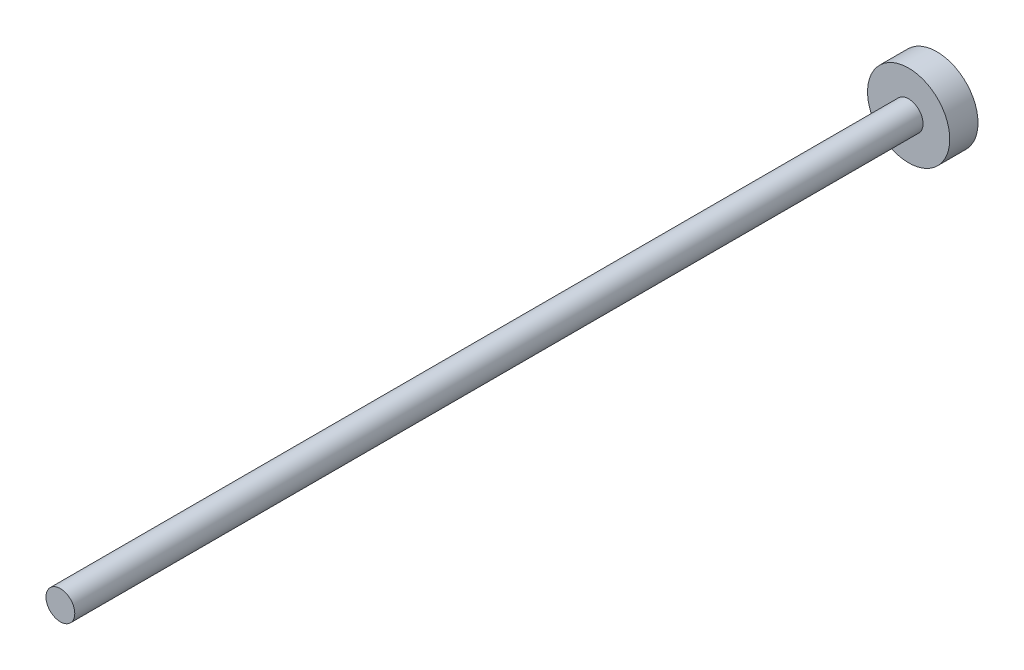
ISO-10303-21;
HEADER;
FILE_DESCRIPTION(('STEP AP214'),'2;1');
FILE_NAME('part.step','',(''),(''),'','','');
FILE_SCHEMA(('AUTOMOTIVE_DESIGN { 1 0 10303 214 1 1 1 1 }'));
ENDSEC;
DATA;
#1=APPLICATION_CONTEXT('core data for automotive mechanical design processes');
#2=APPLICATION_PROTOCOL_DEFINITION('international standard','automotive_design',2000,#1);
#3=PRODUCT_CONTEXT('',#1,'mechanical');
#4=PRODUCT('Part','Part','',(#3));
#5=PRODUCT_RELATED_PRODUCT_CATEGORY('part','',(#4));
#6=PRODUCT_DEFINITION_FORMATION('','',#4);
#7=PRODUCT_DEFINITION_CONTEXT('part definition',#1,'design');
#8=PRODUCT_DEFINITION('design','',#6,#7);
#9=PRODUCT_DEFINITION_SHAPE('','',#8);
#10=(LENGTH_UNIT() NAMED_UNIT(*) SI_UNIT(.MILLI.,.METRE.));
#11=(NAMED_UNIT(*) PLANE_ANGLE_UNIT() SI_UNIT($,.RADIAN.));
#12=(NAMED_UNIT(*) SI_UNIT($,.STERADIAN.) SOLID_ANGLE_UNIT());
#13=UNCERTAINTY_MEASURE_WITH_UNIT(LENGTH_MEASURE(1.E-05),#10,'distance_accuracy_value','');
#14=(GEOMETRIC_REPRESENTATION_CONTEXT(3) GLOBAL_UNCERTAINTY_ASSIGNED_CONTEXT((#13)) GLOBAL_UNIT_ASSIGNED_CONTEXT((#10,
#11,#12)) REPRESENTATION_CONTEXT('',''));
#15=CARTESIAN_POINT('',(0.,0.,0.));
#16=DIRECTION('',(0.,0.,1.));
#17=DIRECTION('',(1.,0.,0.));
#18=AXIS2_PLACEMENT_3D('',#15,#16,#17);
#19=CARTESIAN_POINT('',(0.,0.,3.2));
#20=DIRECTION('',(0.,0.,-1.));
#21=DIRECTION('',(-1.,0.,0.));
#22=AXIS2_PLACEMENT_3D('',#19,#20,#21);
#23=CYLINDRICAL_SURFACE('',#22,4.65);
#24=CARTESIAN_POINT('',(0.,0.,3.2));
#25=DIRECTION('',(0.,0.,1.));
#26=DIRECTION('',(1.,0.,0.));
#27=AXIS2_PLACEMENT_3D('',#24,#25,#26);
#28=CIRCLE('',#27,4.65);
#29=CARTESIAN_POINT('',(4.65,0.,3.2));
#30=VERTEX_POINT('',#29);
#31=EDGE_CURVE('E39',#30,#30,#28,.T.);
#32=ORIENTED_EDGE('',*,*,#31,.F.);
#33=EDGE_LOOP('',(#32));
#34=FACE_BOUND('',#33,.T.);
#35=CARTESIAN_POINT('',(0.,0.,0.));
#36=DIRECTION('',(0.,0.,1.));
#37=DIRECTION('',(1.,0.,0.));
#38=AXIS2_PLACEMENT_3D('',#35,#36,#37);
#39=CIRCLE('',#38,4.65);
#40=CARTESIAN_POINT('',(4.65,0.,0.));
#41=VERTEX_POINT('',#40);
#42=EDGE_CURVE('E35',#41,#41,#39,.T.);
#43=ORIENTED_EDGE('',*,*,#42,.T.);
#44=EDGE_LOOP('',(#43));
#45=FACE_BOUND('',#44,.T.);
#46=ADVANCED_FACE('F32',(#34,#45),#23,.T.);
#47=CARTESIAN_POINT('',(0.,0.,3.2));
#48=DIRECTION('',(0.,0.,1.));
#49=DIRECTION('',(1.,0.,0.));
#50=AXIS2_PLACEMENT_3D('',#47,#48,#49);
#51=PLANE('',#50);
#52=CARTESIAN_POINT('',(0.,0.,3.2));
#53=DIRECTION('',(0.,0.,1.));
#54=DIRECTION('',(1.,0.,0.));
#55=AXIS2_PLACEMENT_3D('',#52,#53,#54);
#56=CIRCLE('',#55,1.63);
#57=CARTESIAN_POINT('',(1.63,0.,3.2));
#58=VERTEX_POINT('',#57);
#59=EDGE_CURVE('E10',#58,#58,#56,.T.);
#60=ORIENTED_EDGE('',*,*,#59,.F.);
#61=EDGE_LOOP('',(#60));
#62=FACE_BOUND('',#61,.T.);
#63=ORIENTED_EDGE('',*,*,#31,.T.);
#64=EDGE_LOOP('',(#63));
#65=FACE_BOUND('',#64,.T.);
#66=ADVANCED_FACE('F56',(#62,#65),#51,.T.);
#67=CARTESIAN_POINT('',(0.,0.,0.));
#68=DIRECTION('',(0.,0.,1.));
#69=DIRECTION('',(1.,0.,0.));
#70=AXIS2_PLACEMENT_3D('',#67,#68,#69);
#71=PLANE('',#70);
#72=ORIENTED_EDGE('',*,*,#42,.F.);
#73=EDGE_LOOP('',(#72));
#74=FACE_BOUND('',#73,.T.);
#75=ADVANCED_FACE('F53',(#74),#71,.F.);
#76=CARTESIAN_POINT('',(0.,0.,99.2));
#77=DIRECTION('',(0.,0.,-1.));
#78=DIRECTION('',(-1.,0.,0.));
#79=AXIS2_PLACEMENT_3D('',#76,#77,#78);
#80=CYLINDRICAL_SURFACE('',#79,1.63);
#81=CARTESIAN_POINT('',(0.,0.,99.2));
#82=DIRECTION('',(0.,0.,1.));
#83=DIRECTION('',(1.,0.,0.));
#84=AXIS2_PLACEMENT_3D('',#81,#82,#83);
#85=CIRCLE('',#84,1.63);
#86=CARTESIAN_POINT('',(1.63,0.,99.2));
#87=VERTEX_POINT('',#86);
#88=EDGE_CURVE('E45',#87,#87,#85,.T.);
#89=ORIENTED_EDGE('',*,*,#88,.F.);
#90=EDGE_LOOP('',(#89));
#91=FACE_BOUND('',#90,.T.);
#92=ORIENTED_EDGE('',*,*,#59,.T.);
#93=EDGE_LOOP('',(#92));
#94=FACE_BOUND('',#93,.T.);
#95=ADVANCED_FACE('F55',(#91,#94),#80,.T.);
#96=CARTESIAN_POINT('',(0.,0.,99.2));
#97=DIRECTION('',(0.,0.,1.));
#98=DIRECTION('',(1.,0.,0.));
#99=AXIS2_PLACEMENT_3D('',#96,#97,#98);
#100=PLANE('',#99);
#101=ORIENTED_EDGE('',*,*,#88,.T.);
#102=EDGE_LOOP('',(#101));
#103=FACE_BOUND('',#102,.T.);
#104=ADVANCED_FACE('F61',(#103),#100,.T.);
#105=CLOSED_SHELL('',(#46,#66,#75,#95,#104));
#106=MANIFOLD_SOLID_BREP('B2',#105);
#107=ADVANCED_BREP_SHAPE_REPRESENTATION('',(#18,#106),#14);
#108=SHAPE_DEFINITION_REPRESENTATION(#9,#107);
ENDSEC;
END-ISO-10303-21;
